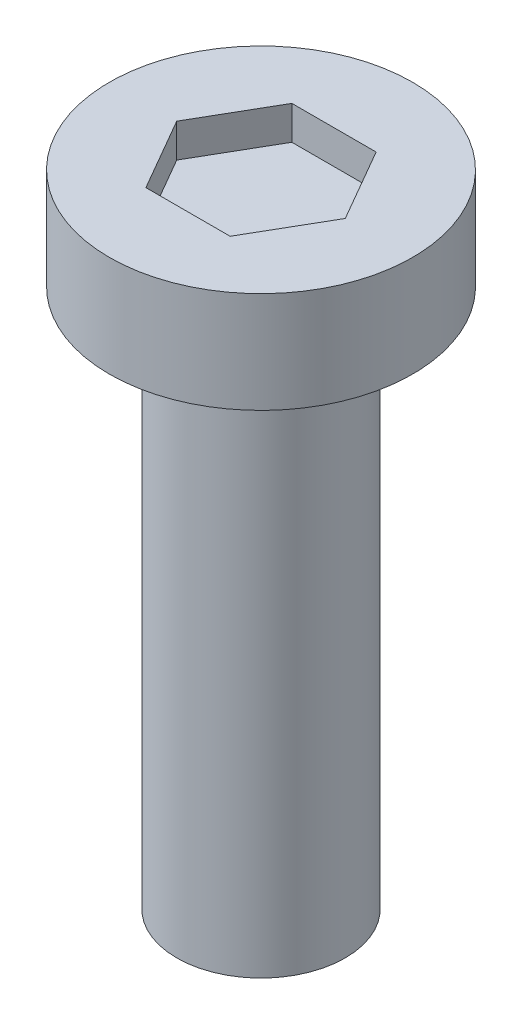
ISO-10303-21;
HEADER;
FILE_DESCRIPTION(('STEP AP214'),'2;1');
FILE_NAME('part.step','',(''),(''),'','','');
FILE_SCHEMA(('AUTOMOTIVE_DESIGN { 1 0 10303 214 1 1 1 1 }'));
ENDSEC;
DATA;
#1=APPLICATION_CONTEXT('core data for automotive mechanical design processes');
#2=APPLICATION_PROTOCOL_DEFINITION('international standard','automotive_design',2000,#1);
#3=PRODUCT_CONTEXT('',#1,'mechanical');
#4=PRODUCT('Part','Part','',(#3));
#5=PRODUCT_RELATED_PRODUCT_CATEGORY('part','',(#4));
#6=PRODUCT_DEFINITION_FORMATION('','',#4);
#7=PRODUCT_DEFINITION_CONTEXT('part definition',#1,'design');
#8=PRODUCT_DEFINITION('design','',#6,#7);
#9=PRODUCT_DEFINITION_SHAPE('','',#8);
#10=(LENGTH_UNIT() NAMED_UNIT(*) SI_UNIT(.MILLI.,.METRE.));
#11=(NAMED_UNIT(*) PLANE_ANGLE_UNIT() SI_UNIT($,.RADIAN.));
#12=(NAMED_UNIT(*) SI_UNIT($,.STERADIAN.) SOLID_ANGLE_UNIT());
#13=UNCERTAINTY_MEASURE_WITH_UNIT(LENGTH_MEASURE(1.E-05),#10,'distance_accuracy_value','');
#14=(GEOMETRIC_REPRESENTATION_CONTEXT(3) GLOBAL_UNCERTAINTY_ASSIGNED_CONTEXT((#13)) GLOBAL_UNIT_ASSIGNED_CONTEXT((#10,
#11,#12)) REPRESENTATION_CONTEXT('',''));
#15=CARTESIAN_POINT('',(0.,0.,0.));
#16=DIRECTION('',(0.,0.,1.));
#17=DIRECTION('',(1.,0.,0.));
#18=AXIS2_PLACEMENT_3D('',#15,#16,#17);
#19=CARTESIAN_POINT('',(0.,8.,0.));
#20=DIRECTION('',(0.,-1.,0.));
#21=DIRECTION('',(0.,0.,-1.));
#22=AXIS2_PLACEMENT_3D('',#19,#20,#21);
#23=CYLINDRICAL_SURFACE('',#22,1.25);
#24=CARTESIAN_POINT('',(0.,8.,0.));
#25=DIRECTION('',(0.,1.,0.));
#26=DIRECTION('',(0.,0.,1.));
#27=AXIS2_PLACEMENT_3D('',#24,#25,#26);
#28=CIRCLE('',#27,1.25);
#29=CARTESIAN_POINT('',(0.,8.,1.25));
#30=VERTEX_POINT('',#29);
#31=EDGE_CURVE('E11',#30,#30,#28,.T.);
#32=ORIENTED_EDGE('',*,*,#31,.F.);
#33=EDGE_LOOP('',(#32));
#34=FACE_BOUND('',#33,.T.);
#35=CARTESIAN_POINT('',(0.,0.,0.));
#36=DIRECTION('',(0.,1.,0.));
#37=DIRECTION('',(0.,0.,1.));
#38=AXIS2_PLACEMENT_3D('',#35,#36,#37);
#39=CIRCLE('',#38,1.25);
#40=CARTESIAN_POINT('',(0.,0.,1.25));
#41=VERTEX_POINT('',#40);
#42=EDGE_CURVE('E42',#41,#41,#39,.T.);
#43=ORIENTED_EDGE('',*,*,#42,.T.);
#44=EDGE_LOOP('',(#43));
#45=FACE_BOUND('',#44,.T.);
#46=ADVANCED_FACE('F39',(#34,#45),#23,.T.);
#47=CARTESIAN_POINT('',(0.,0.,0.));
#48=DIRECTION('',(0.,1.,0.));
#49=DIRECTION('',(0.,0.,1.));
#50=AXIS2_PLACEMENT_3D('',#47,#48,#49);
#51=PLANE('',#50);
#52=ORIENTED_EDGE('',*,*,#42,.F.);
#53=EDGE_LOOP('',(#52));
#54=FACE_BOUND('',#53,.T.);
#55=ADVANCED_FACE('F189',(#54),#51,.F.);
#56=CARTESIAN_POINT('',(0.,9.5,0.));
#57=DIRECTION('',(0.,-1.,0.));
#58=DIRECTION('',(0.,0.,-1.));
#59=AXIS2_PLACEMENT_3D('',#56,#57,#58);
#60=CYLINDRICAL_SURFACE('',#59,2.25);
#61=CARTESIAN_POINT('',(0.,9.5,0.));
#62=DIRECTION('',(0.,1.,0.));
#63=DIRECTION('',(0.,0.,1.));
#64=AXIS2_PLACEMENT_3D('',#61,#62,#63);
#65=CIRCLE('',#64,2.25);
#66=CARTESIAN_POINT('',(0.,9.5,2.25));
#67=VERTEX_POINT('',#66);
#68=EDGE_CURVE('E163',#67,#67,#65,.T.);
#69=ORIENTED_EDGE('',*,*,#68,.F.);
#70=EDGE_LOOP('',(#69));
#71=FACE_BOUND('',#70,.T.);
#72=CARTESIAN_POINT('',(0.,8.,0.));
#73=DIRECTION('',(0.,1.,0.));
#74=DIRECTION('',(0.,0.,1.));
#75=AXIS2_PLACEMENT_3D('',#72,#73,#74);
#76=CIRCLE('',#75,2.25);
#77=CARTESIAN_POINT('',(0.,8.,2.25));
#78=VERTEX_POINT('',#77);
#79=EDGE_CURVE('E153',#78,#78,#76,.T.);
#80=ORIENTED_EDGE('',*,*,#79,.T.);
#81=EDGE_LOOP('',(#80));
#82=FACE_BOUND('',#81,.T.);
#83=ADVANCED_FACE('F171',(#71,#82),#60,.T.);
#84=CARTESIAN_POINT('',(0.,9.5,0.));
#85=DIRECTION('',(0.,1.,0.));
#86=DIRECTION('',(0.,0.,1.));
#87=AXIS2_PLACEMENT_3D('',#84,#85,#86);
#88=PLANE('',#87);
#89=DIRECTION('',(0.5,0.,-0.866025403784439));
#90=VECTOR('',#89,1.);
#91=CARTESIAN_POINT('',(0.625,9.5,1.08253175473055));
#92=LINE('',#91,#90);
#93=CARTESIAN_POINT('',(0.625,9.5,1.08253175473055));
#94=VERTEX_POINT('',#93);
#95=CARTESIAN_POINT('',(1.25,9.5,0.));
#96=VERTEX_POINT('',#95);
#97=EDGE_CURVE('E54',#94,#96,#92,.T.);
#98=ORIENTED_EDGE('',*,*,#97,.F.);
#99=DIRECTION('',(1.,0.,0.));
#100=VECTOR('',#99,1.);
#101=CARTESIAN_POINT('',(-0.625,9.5,1.08253175473055));
#102=LINE('',#101,#100);
#103=CARTESIAN_POINT('',(-0.625,9.5,1.08253175473055));
#104=VERTEX_POINT('',#103);
#105=EDGE_CURVE('E147',#104,#94,#102,.T.);
#106=ORIENTED_EDGE('',*,*,#105,.F.);
#107=DIRECTION('',(0.5,0.,0.866025403784439));
#108=VECTOR('',#107,1.);
#109=CARTESIAN_POINT('',(-1.25,9.5,0.));
#110=LINE('',#109,#108);
#111=CARTESIAN_POINT('',(-1.25,9.5,0.));
#112=VERTEX_POINT('',#111);
#113=EDGE_CURVE('E144',#112,#104,#110,.T.);
#114=ORIENTED_EDGE('',*,*,#113,.F.);
#115=DIRECTION('',(-0.5,0.,0.866025403784439));
#116=VECTOR('',#115,1.);
#117=CARTESIAN_POINT('',(-0.625,9.5,-1.08253175473055));
#118=LINE('',#117,#116);
#119=CARTESIAN_POINT('',(-0.625,9.5,-1.08253175473055));
#120=VERTEX_POINT('',#119);
#121=EDGE_CURVE('E102',#120,#112,#118,.T.);
#122=ORIENTED_EDGE('',*,*,#121,.F.);
#123=DIRECTION('',(-1.,0.,0.));
#124=VECTOR('',#123,1.);
#125=CARTESIAN_POINT('',(0.625,9.5,-1.08253175473055));
#126=LINE('',#125,#124);
#127=CARTESIAN_POINT('',(0.625,9.5,-1.08253175473055));
#128=VERTEX_POINT('',#127);
#129=EDGE_CURVE('E138',#128,#120,#126,.T.);
#130=ORIENTED_EDGE('',*,*,#129,.F.);
#131=DIRECTION('',(-0.5,0.,-0.866025403784439));
#132=VECTOR('',#131,1.);
#133=CARTESIAN_POINT('',(1.25,9.5,0.));
#134=LINE('',#133,#132);
#135=EDGE_CURVE('E134',#96,#128,#134,.T.);
#136=ORIENTED_EDGE('',*,*,#135,.F.);
#137=EDGE_LOOP('',(#98,#106,#114,#122,#130,#136));
#138=FACE_BOUND('',#137,.T.);
#139=ORIENTED_EDGE('',*,*,#68,.T.);
#140=EDGE_LOOP('',(#139));
#141=FACE_BOUND('',#140,.T.);
#142=ADVANCED_FACE('F176',(#138,#141),#88,.T.);
#143=CARTESIAN_POINT('',(0.,8.,0.));
#144=DIRECTION('',(0.,1.,0.));
#145=DIRECTION('',(0.,0.,1.));
#146=AXIS2_PLACEMENT_3D('',#143,#144,#145);
#147=PLANE('',#146);
#148=ORIENTED_EDGE('',*,*,#31,.T.);
#149=EDGE_LOOP('',(#148));
#150=FACE_BOUND('',#149,.T.);
#151=ORIENTED_EDGE('',*,*,#79,.F.);
#152=EDGE_LOOP('',(#151));
#153=FACE_BOUND('',#152,.T.);
#154=ADVANCED_FACE('F173',(#150,#153),#147,.F.);
#155=CARTESIAN_POINT('',(0.625,9.,1.08253175473055));
#156=DIRECTION('',(0.866025403784439,0.,0.5));
#157=DIRECTION('',(0.5,0.,-0.866025403784439));
#158=AXIS2_PLACEMENT_3D('',#155,#156,#157);
#159=PLANE('',#158);
#160=ORIENTED_EDGE('',*,*,#97,.T.);
#161=DIRECTION('',(0.,1.,0.));
#162=VECTOR('',#161,1.);
#163=CARTESIAN_POINT('',(1.25,9.,0.));
#164=LINE('',#163,#162);
#165=CARTESIAN_POINT('',(1.25,9.,0.));
#166=VERTEX_POINT('',#165);
#167=EDGE_CURVE('E84',#166,#96,#164,.T.);
#168=ORIENTED_EDGE('',*,*,#167,.F.);
#169=DIRECTION('',(0.5,0.,-0.866025403784439));
#170=VECTOR('',#169,1.);
#171=CARTESIAN_POINT('',(0.625,9.,1.08253175473055));
#172=LINE('',#171,#170);
#173=CARTESIAN_POINT('',(0.625,9.,1.08253175473055));
#174=VERTEX_POINT('',#173);
#175=EDGE_CURVE('E150',#174,#166,#172,.T.);
#176=ORIENTED_EDGE('',*,*,#175,.F.);
#177=DIRECTION('',(0.,1.,0.));
#178=VECTOR('',#177,1.);
#179=CARTESIAN_POINT('',(0.625,9.,1.08253175473055));
#180=LINE('',#179,#178);
#181=EDGE_CURVE('E62',#174,#94,#180,.T.);
#182=ORIENTED_EDGE('',*,*,#181,.T.);
#183=EDGE_LOOP('',(#160,#168,#176,#182));
#184=FACE_BOUND('',#183,.T.);
#185=ADVANCED_FACE('F175',(#184),#159,.F.);
#186=CARTESIAN_POINT('',(-0.625,9.,1.08253175473055));
#187=DIRECTION('',(0.,0.,1.));
#188=DIRECTION('',(1.,0.,0.));
#189=AXIS2_PLACEMENT_3D('',#186,#187,#188);
#190=PLANE('',#189);
#191=ORIENTED_EDGE('',*,*,#105,.T.);
#192=ORIENTED_EDGE('',*,*,#181,.F.);
#193=DIRECTION('',(1.,0.,0.));
#194=VECTOR('',#193,1.);
#195=CARTESIAN_POINT('',(-0.625,9.,1.08253175473055));
#196=LINE('',#195,#194);
#197=CARTESIAN_POINT('',(-0.625,9.,1.08253175473055));
#198=VERTEX_POINT('',#197);
#199=EDGE_CURVE('E116',#198,#174,#196,.T.);
#200=ORIENTED_EDGE('',*,*,#199,.F.);
#201=DIRECTION('',(0.,1.,0.));
#202=VECTOR('',#201,1.);
#203=CARTESIAN_POINT('',(-0.625,9.,1.08253175473055));
#204=LINE('',#203,#202);
#205=EDGE_CURVE('E107',#198,#104,#204,.T.);
#206=ORIENTED_EDGE('',*,*,#205,.T.);
#207=EDGE_LOOP('',(#191,#192,#200,#206));
#208=FACE_BOUND('',#207,.T.);
#209=ADVANCED_FACE('F183',(#208),#190,.F.);
#210=CARTESIAN_POINT('',(-1.25,9.,0.));
#211=DIRECTION('',(-0.866025403784439,0.,0.5));
#212=DIRECTION('',(0.5,0.,0.866025403784439));
#213=AXIS2_PLACEMENT_3D('',#210,#211,#212);
#214=PLANE('',#213);
#215=ORIENTED_EDGE('',*,*,#113,.T.);
#216=ORIENTED_EDGE('',*,*,#205,.F.);
#217=DIRECTION('',(0.5,0.,0.866025403784439));
#218=VECTOR('',#217,1.);
#219=CARTESIAN_POINT('',(-1.25,9.,0.));
#220=LINE('',#219,#218);
#221=CARTESIAN_POINT('',(-1.25,9.,0.));
#222=VERTEX_POINT('',#221);
#223=EDGE_CURVE('E111',#222,#198,#220,.T.);
#224=ORIENTED_EDGE('',*,*,#223,.F.);
#225=DIRECTION('',(0.,1.,0.));
#226=VECTOR('',#225,1.);
#227=CARTESIAN_POINT('',(-1.25,9.,0.));
#228=LINE('',#227,#226);
#229=EDGE_CURVE('E95',#222,#112,#228,.T.);
#230=ORIENTED_EDGE('',*,*,#229,.T.);
#231=EDGE_LOOP('',(#215,#216,#224,#230));
#232=FACE_BOUND('',#231,.T.);
#233=ADVANCED_FACE('F112',(#232),#214,.F.);
#234=CARTESIAN_POINT('',(-0.625,9.,-1.08253175473055));
#235=DIRECTION('',(-0.866025403784439,0.,-0.5));
#236=DIRECTION('',(-0.5,0.,0.866025403784439));
#237=AXIS2_PLACEMENT_3D('',#234,#235,#236);
#238=PLANE('',#237);
#239=ORIENTED_EDGE('',*,*,#121,.T.);
#240=ORIENTED_EDGE('',*,*,#229,.F.);
#241=DIRECTION('',(-0.5,0.,0.866025403784439));
#242=VECTOR('',#241,1.);
#243=CARTESIAN_POINT('',(-0.625,9.,-1.08253175473055));
#244=LINE('',#243,#242);
#245=CARTESIAN_POINT('',(-0.625,9.,-1.08253175473055));
#246=VERTEX_POINT('',#245);
#247=EDGE_CURVE('E99',#246,#222,#244,.T.);
#248=ORIENTED_EDGE('',*,*,#247,.F.);
#249=DIRECTION('',(0.,1.,0.));
#250=VECTOR('',#249,1.);
#251=CARTESIAN_POINT('',(-0.625,9.,-1.08253175473055));
#252=LINE('',#251,#250);
#253=EDGE_CURVE('E108',#246,#120,#252,.T.);
#254=ORIENTED_EDGE('',*,*,#253,.T.);
#255=EDGE_LOOP('',(#239,#240,#248,#254));
#256=FACE_BOUND('',#255,.T.);
#257=ADVANCED_FACE('F97',(#256),#238,.F.);
#258=CARTESIAN_POINT('',(0.625,9.,-1.08253175473055));
#259=DIRECTION('',(0.,0.,-1.));
#260=DIRECTION('',(-1.,0.,0.));
#261=AXIS2_PLACEMENT_3D('',#258,#259,#260);
#262=PLANE('',#261);
#263=ORIENTED_EDGE('',*,*,#129,.T.);
#264=ORIENTED_EDGE('',*,*,#253,.F.);
#265=DIRECTION('',(-1.,0.,0.));
#266=VECTOR('',#265,1.);
#267=CARTESIAN_POINT('',(0.625,9.,-1.08253175473055));
#268=LINE('',#267,#266);
#269=CARTESIAN_POINT('',(0.625,9.,-1.08253175473055));
#270=VERTEX_POINT('',#269);
#271=EDGE_CURVE('E122',#270,#246,#268,.T.);
#272=ORIENTED_EDGE('',*,*,#271,.F.);
#273=DIRECTION('',(0.,1.,0.));
#274=VECTOR('',#273,1.);
#275=CARTESIAN_POINT('',(0.625,9.,-1.08253175473055));
#276=LINE('',#275,#274);
#277=EDGE_CURVE('E158',#270,#128,#276,.T.);
#278=ORIENTED_EDGE('',*,*,#277,.T.);
#279=EDGE_LOOP('',(#263,#264,#272,#278));
#280=FACE_BOUND('',#279,.T.);
#281=ADVANCED_FACE('F245',(#280),#262,.F.);
#282=CARTESIAN_POINT('',(1.25,9.,0.));
#283=DIRECTION('',(0.866025403784439,0.,-0.5));
#284=DIRECTION('',(-0.5,0.,-0.866025403784439));
#285=AXIS2_PLACEMENT_3D('',#282,#283,#284);
#286=PLANE('',#285);
#287=ORIENTED_EDGE('',*,*,#135,.T.);
#288=ORIENTED_EDGE('',*,*,#277,.F.);
#289=DIRECTION('',(-0.5,0.,-0.866025403784439));
#290=VECTOR('',#289,1.);
#291=CARTESIAN_POINT('',(1.25,9.,0.));
#292=LINE('',#291,#290);
#293=EDGE_CURVE('E126',#166,#270,#292,.T.);
#294=ORIENTED_EDGE('',*,*,#293,.F.);
#295=ORIENTED_EDGE('',*,*,#167,.T.);
#296=EDGE_LOOP('',(#287,#288,#294,#295));
#297=FACE_BOUND('',#296,.T.);
#298=ADVANCED_FACE('F254',(#297),#286,.F.);
#299=CARTESIAN_POINT('',(0.,9.,0.));
#300=DIRECTION('',(0.,1.,0.));
#301=DIRECTION('',(0.,0.,1.));
#302=AXIS2_PLACEMENT_3D('',#299,#300,#301);
#303=PLANE('',#302);
#304=ORIENTED_EDGE('',*,*,#175,.T.);
#305=ORIENTED_EDGE('',*,*,#293,.T.);
#306=ORIENTED_EDGE('',*,*,#271,.T.);
#307=ORIENTED_EDGE('',*,*,#247,.T.);
#308=ORIENTED_EDGE('',*,*,#223,.T.);
#309=ORIENTED_EDGE('',*,*,#199,.T.);
#310=EDGE_LOOP('',(#304,#305,#306,#307,#308,#309));
#311=FACE_BOUND('',#310,.T.);
#312=ADVANCED_FACE('F119',(#311),#303,.T.);
#313=CLOSED_SHELL('',(#46,#55,#83,#142,#154,#185,#209,#233,#257,#281,#298,#312));
#314=MANIFOLD_SOLID_BREP('B2',#313);
#315=ADVANCED_BREP_SHAPE_REPRESENTATION('',(#18,#314),#14);
#316=SHAPE_DEFINITION_REPRESENTATION(#9,#315);
ENDSEC;
END-ISO-10303-21;
